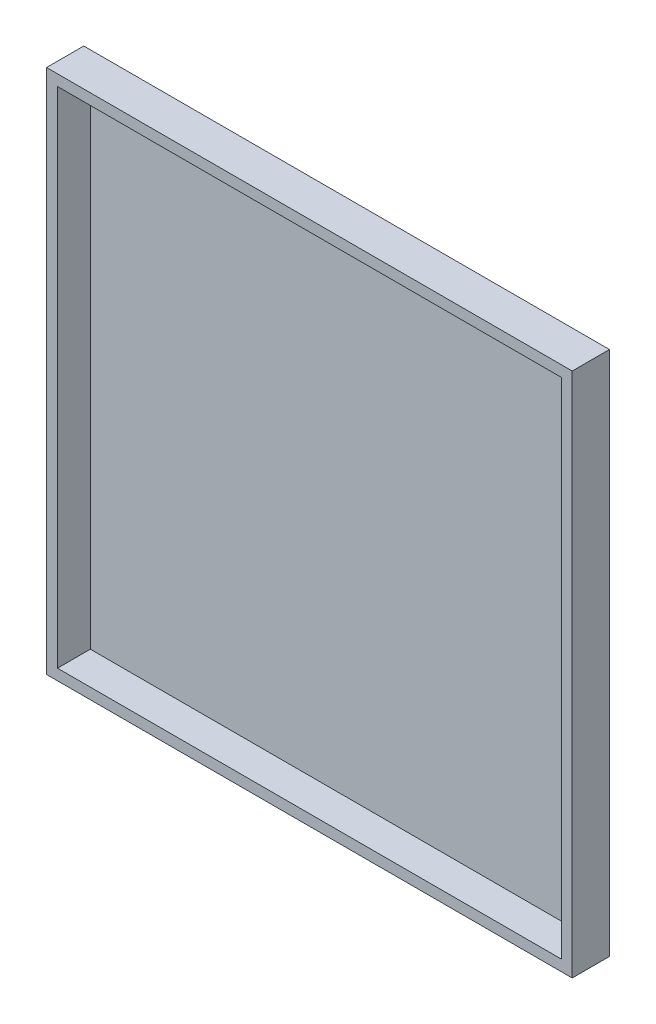
ISO-10303-21;
HEADER;
FILE_DESCRIPTION(('STEP AP214'),'2;1');
FILE_NAME('part.step','',(''),(''),'','','');
FILE_SCHEMA(('AUTOMOTIVE_DESIGN { 1 0 10303 214 1 1 1 1 }'));
ENDSEC;
DATA;
#1=APPLICATION_CONTEXT('core data for automotive mechanical design processes');
#2=APPLICATION_PROTOCOL_DEFINITION('international standard','automotive_design',2000,#1);
#3=PRODUCT_CONTEXT('',#1,'mechanical');
#4=PRODUCT('Part','Part','',(#3));
#5=PRODUCT_RELATED_PRODUCT_CATEGORY('part','',(#4));
#6=PRODUCT_DEFINITION_FORMATION('','',#4);
#7=PRODUCT_DEFINITION_CONTEXT('part definition',#1,'design');
#8=PRODUCT_DEFINITION('design','',#6,#7);
#9=PRODUCT_DEFINITION_SHAPE('','',#8);
#10=(LENGTH_UNIT() NAMED_UNIT(*) SI_UNIT(.MILLI.,.METRE.));
#11=(NAMED_UNIT(*) PLANE_ANGLE_UNIT() SI_UNIT($,.RADIAN.));
#12=(NAMED_UNIT(*) SI_UNIT($,.STERADIAN.) SOLID_ANGLE_UNIT());
#13=UNCERTAINTY_MEASURE_WITH_UNIT(LENGTH_MEASURE(1.E-05),#10,'distance_accuracy_value','');
#14=(GEOMETRIC_REPRESENTATION_CONTEXT(3) GLOBAL_UNCERTAINTY_ASSIGNED_CONTEXT((#13)) GLOBAL_UNIT_ASSIGNED_CONTEXT((#10,
#11,#12)) REPRESENTATION_CONTEXT('',''));
#15=CARTESIAN_POINT('',(0.,0.,0.));
#16=DIRECTION('',(0.,0.,1.));
#17=DIRECTION('',(1.,0.,0.));
#18=AXIS2_PLACEMENT_3D('',#15,#16,#17);
#19=CARTESIAN_POINT('',(-1200.,-1200.,20.));
#20=DIRECTION('',(1.,0.,0.));
#21=DIRECTION('',(0.,0.,-1.));
#22=AXIS2_PLACEMENT_3D('',#19,#20,#21);
#23=PLANE('',#22);
#24=DIRECTION('',(0.,-1.,0.));
#25=VECTOR('',#24,1.);
#26=CARTESIAN_POINT('',(-1200.,-1200.,0.));
#27=LINE('',#26,#25);
#28=CARTESIAN_POINT('',(-1200.,1200.,0.));
#29=VERTEX_POINT('',#28);
#30=CARTESIAN_POINT('',(-1200.,-1200.,0.));
#31=VERTEX_POINT('',#30);
#32=EDGE_CURVE('E145',#29,#31,#27,.T.);
#33=ORIENTED_EDGE('',*,*,#32,.T.);
#34=DIRECTION('',(0.,0.,-1.));
#35=VECTOR('',#34,1.);
#36=CARTESIAN_POINT('',(-1200.,-1200.,20.));
#37=LINE('',#36,#35);
#38=CARTESIAN_POINT('',(-1200.,-1200.,170.));
#39=VERTEX_POINT('',#38);
#40=EDGE_CURVE('E11',#39,#31,#37,.T.);
#41=ORIENTED_EDGE('',*,*,#40,.F.);
#42=DIRECTION('',(0.,-1.,0.));
#43=VECTOR('',#42,1.);
#44=CARTESIAN_POINT('',(-1200.,-1200.,170.));
#45=LINE('',#44,#43);
#46=CARTESIAN_POINT('',(-1200.,1200.,170.));
#47=VERTEX_POINT('',#46);
#48=EDGE_CURVE('E112',#47,#39,#45,.T.);
#49=ORIENTED_EDGE('',*,*,#48,.F.);
#50=DIRECTION('',(0.,0.,-1.));
#51=VECTOR('',#50,1.);
#52=CARTESIAN_POINT('',(-1200.,1200.,20.));
#53=LINE('',#52,#51);
#54=EDGE_CURVE('E154',#47,#29,#53,.T.);
#55=ORIENTED_EDGE('',*,*,#54,.T.);
#56=EDGE_LOOP('',(#33,#41,#49,#55));
#57=FACE_BOUND('',#56,.T.);
#58=ADVANCED_FACE('F34',(#57),#23,.F.);
#59=CARTESIAN_POINT('',(1200.,-1200.,20.));
#60=DIRECTION('',(0.,1.,0.));
#61=DIRECTION('',(-1.,0.,0.));
#62=AXIS2_PLACEMENT_3D('',#59,#60,#61);
#63=PLANE('',#62);
#64=DIRECTION('',(1.,0.,0.));
#65=VECTOR('',#64,1.);
#66=CARTESIAN_POINT('',(1200.,-1200.,0.));
#67=LINE('',#66,#65);
#68=CARTESIAN_POINT('',(1200.,-1200.,0.));
#69=VERTEX_POINT('',#68);
#70=EDGE_CURVE('E148',#31,#69,#67,.T.);
#71=ORIENTED_EDGE('',*,*,#70,.T.);
#72=DIRECTION('',(0.,0.,-1.));
#73=VECTOR('',#72,1.);
#74=CARTESIAN_POINT('',(1200.,-1200.,20.));
#75=LINE('',#74,#73);
#76=CARTESIAN_POINT('',(1200.,-1200.,170.));
#77=VERTEX_POINT('',#76);
#78=EDGE_CURVE('E41',#77,#69,#75,.T.);
#79=ORIENTED_EDGE('',*,*,#78,.F.);
#80=DIRECTION('',(1.,0.,0.));
#81=VECTOR('',#80,1.);
#82=CARTESIAN_POINT('',(1200.,-1200.,170.));
#83=LINE('',#82,#81);
#84=EDGE_CURVE('E136',#39,#77,#83,.T.);
#85=ORIENTED_EDGE('',*,*,#84,.F.);
#86=ORIENTED_EDGE('',*,*,#40,.T.);
#87=EDGE_LOOP('',(#71,#79,#85,#86));
#88=FACE_BOUND('',#87,.T.);
#89=ADVANCED_FACE('F176',(#88),#63,.F.);
#90=CARTESIAN_POINT('',(1200.,-1200.,20.));
#91=DIRECTION('',(-1.,0.,0.));
#92=DIRECTION('',(0.,0.,1.));
#93=AXIS2_PLACEMENT_3D('',#90,#91,#92);
#94=PLANE('',#93);
#95=DIRECTION('',(0.,1.,0.));
#96=VECTOR('',#95,1.);
#97=CARTESIAN_POINT('',(1200.,-1200.,0.));
#98=LINE('',#97,#96);
#99=CARTESIAN_POINT('',(1200.,1200.,0.));
#100=VERTEX_POINT('',#99);
#101=EDGE_CURVE('E150',#69,#100,#98,.T.);
#102=ORIENTED_EDGE('',*,*,#101,.T.);
#103=DIRECTION('',(0.,0.,-1.));
#104=VECTOR('',#103,1.);
#105=CARTESIAN_POINT('',(1200.,1200.,20.));
#106=LINE('',#105,#104);
#107=CARTESIAN_POINT('',(1200.,1200.,170.));
#108=VERTEX_POINT('',#107);
#109=EDGE_CURVE('E157',#108,#100,#106,.T.);
#110=ORIENTED_EDGE('',*,*,#109,.F.);
#111=DIRECTION('',(0.,1.,0.));
#112=VECTOR('',#111,1.);
#113=CARTESIAN_POINT('',(1200.,-1200.,170.));
#114=LINE('',#113,#112);
#115=EDGE_CURVE('E139',#77,#108,#114,.T.);
#116=ORIENTED_EDGE('',*,*,#115,.F.);
#117=ORIENTED_EDGE('',*,*,#78,.T.);
#118=EDGE_LOOP('',(#102,#110,#116,#117));
#119=FACE_BOUND('',#118,.T.);
#120=ADVANCED_FACE('F163',(#119),#94,.F.);
#121=CARTESIAN_POINT('',(1200.,1200.,20.));
#122=DIRECTION('',(0.,-1.,0.));
#123=DIRECTION('',(1.,0.,0.));
#124=AXIS2_PLACEMENT_3D('',#121,#122,#123);
#125=PLANE('',#124);
#126=DIRECTION('',(-1.,0.,0.));
#127=VECTOR('',#126,1.);
#128=CARTESIAN_POINT('',(1200.,1200.,0.));
#129=LINE('',#128,#127);
#130=EDGE_CURVE('E152',#100,#29,#129,.T.);
#131=ORIENTED_EDGE('',*,*,#130,.T.);
#132=ORIENTED_EDGE('',*,*,#54,.F.);
#133=DIRECTION('',(-1.,0.,0.));
#134=VECTOR('',#133,1.);
#135=CARTESIAN_POINT('',(1200.,1200.,170.));
#136=LINE('',#135,#134);
#137=EDGE_CURVE('E142',#108,#47,#136,.T.);
#138=ORIENTED_EDGE('',*,*,#137,.F.);
#139=ORIENTED_EDGE('',*,*,#109,.T.);
#140=EDGE_LOOP('',(#131,#132,#138,#139));
#141=FACE_BOUND('',#140,.T.);
#142=ADVANCED_FACE('F171',(#141),#125,.F.);
#143=CARTESIAN_POINT('',(0.,0.,0.));
#144=DIRECTION('',(0.,0.,1.));
#145=DIRECTION('',(1.,0.,0.));
#146=AXIS2_PLACEMENT_3D('',#143,#144,#145);
#147=PLANE('',#146);
#148=ORIENTED_EDGE('',*,*,#32,.F.);
#149=ORIENTED_EDGE('',*,*,#130,.F.);
#150=ORIENTED_EDGE('',*,*,#101,.F.);
#151=ORIENTED_EDGE('',*,*,#70,.F.);
#152=EDGE_LOOP('',(#148,#149,#150,#151));
#153=FACE_BOUND('',#152,.T.);
#154=ADVANCED_FACE('F169',(#153),#147,.F.);
#155=CARTESIAN_POINT('',(0.,0.,170.));
#156=DIRECTION('',(0.,0.,1.));
#157=DIRECTION('',(1.,0.,0.));
#158=AXIS2_PLACEMENT_3D('',#155,#156,#157);
#159=PLANE('',#158);
#160=ORIENTED_EDGE('',*,*,#48,.T.);
#161=ORIENTED_EDGE('',*,*,#84,.T.);
#162=ORIENTED_EDGE('',*,*,#115,.T.);
#163=ORIENTED_EDGE('',*,*,#137,.T.);
#164=EDGE_LOOP('',(#160,#161,#162,#163));
#165=FACE_BOUND('',#164,.T.);
#166=DIRECTION('',(1.,0.,0.));
#167=VECTOR('',#166,1.);
#168=CARTESIAN_POINT('',(-1150.,-1150.,170.));
#169=LINE('',#168,#167);
#170=CARTESIAN_POINT('',(-1150.,-1150.,170.));
#171=VERTEX_POINT('',#170);
#172=CARTESIAN_POINT('',(1150.,-1150.,170.));
#173=VERTEX_POINT('',#172);
#174=EDGE_CURVE('E106',#171,#173,#169,.T.);
#175=ORIENTED_EDGE('',*,*,#174,.F.);
#176=DIRECTION('',(0.,-1.,0.));
#177=VECTOR('',#176,1.);
#178=CARTESIAN_POINT('',(-1150.,1150.,170.));
#179=LINE('',#178,#177);
#180=CARTESIAN_POINT('',(-1150.,1150.,170.));
#181=VERTEX_POINT('',#180);
#182=EDGE_CURVE('E97',#181,#171,#179,.T.);
#183=ORIENTED_EDGE('',*,*,#182,.F.);
#184=DIRECTION('',(-1.,0.,0.));
#185=VECTOR('',#184,1.);
#186=CARTESIAN_POINT('',(1150.,1150.,170.));
#187=LINE('',#186,#185);
#188=CARTESIAN_POINT('',(1150.,1150.,170.));
#189=VERTEX_POINT('',#188);
#190=EDGE_CURVE('E120',#189,#181,#187,.T.);
#191=ORIENTED_EDGE('',*,*,#190,.F.);
#192=DIRECTION('',(0.,1.,0.));
#193=VECTOR('',#192,1.);
#194=CARTESIAN_POINT('',(1150.,-1150.,170.));
#195=LINE('',#194,#193);
#196=EDGE_CURVE('E118',#173,#189,#195,.T.);
#197=ORIENTED_EDGE('',*,*,#196,.F.);
#198=EDGE_LOOP('',(#175,#183,#191,#197));
#199=FACE_BOUND('',#198,.T.);
#200=ADVANCED_FACE('F116',(#165,#199),#159,.T.);
#201=CARTESIAN_POINT('',(-1150.,1150.,170.));
#202=DIRECTION('',(1.,0.,0.));
#203=DIRECTION('',(0.,0.,-1.));
#204=AXIS2_PLACEMENT_3D('',#201,#202,#203);
#205=PLANE('',#204);
#206=DIRECTION('',(0.,-1.,0.));
#207=VECTOR('',#206,1.);
#208=CARTESIAN_POINT('',(-1150.,1150.,20.));
#209=LINE('',#208,#207);
#210=CARTESIAN_POINT('',(-1150.,1150.,20.));
#211=VERTEX_POINT('',#210);
#212=CARTESIAN_POINT('',(-1150.,-1150.,20.));
#213=VERTEX_POINT('',#212);
#214=EDGE_CURVE('E48',#211,#213,#209,.T.);
#215=ORIENTED_EDGE('',*,*,#214,.F.);
#216=DIRECTION('',(0.,0.,-1.));
#217=VECTOR('',#216,1.);
#218=CARTESIAN_POINT('',(-1150.,1150.,170.));
#219=LINE('',#218,#217);
#220=EDGE_CURVE('E102',#181,#211,#219,.T.);
#221=ORIENTED_EDGE('',*,*,#220,.F.);
#222=ORIENTED_EDGE('',*,*,#182,.T.);
#223=DIRECTION('',(0.,0.,-1.));
#224=VECTOR('',#223,1.);
#225=CARTESIAN_POINT('',(-1150.,-1150.,170.));
#226=LINE('',#225,#224);
#227=EDGE_CURVE('E100',#171,#213,#226,.T.);
#228=ORIENTED_EDGE('',*,*,#227,.T.);
#229=EDGE_LOOP('',(#215,#221,#222,#228));
#230=FACE_BOUND('',#229,.T.);
#231=ADVANCED_FACE('F99',(#230),#205,.T.);
#232=CARTESIAN_POINT('',(-1150.,-1150.,170.));
#233=DIRECTION('',(0.,1.,0.));
#234=DIRECTION('',(-1.,0.,0.));
#235=AXIS2_PLACEMENT_3D('',#232,#233,#234);
#236=PLANE('',#235);
#237=DIRECTION('',(1.,0.,0.));
#238=VECTOR('',#237,1.);
#239=CARTESIAN_POINT('',(-1150.,-1150.,20.));
#240=LINE('',#239,#238);
#241=CARTESIAN_POINT('',(1150.,-1150.,20.));
#242=VERTEX_POINT('',#241);
#243=EDGE_CURVE('E52',#213,#242,#240,.T.);
#244=ORIENTED_EDGE('',*,*,#243,.F.);
#245=ORIENTED_EDGE('',*,*,#227,.F.);
#246=ORIENTED_EDGE('',*,*,#174,.T.);
#247=DIRECTION('',(0.,0.,-1.));
#248=VECTOR('',#247,1.);
#249=CARTESIAN_POINT('',(1150.,-1150.,170.));
#250=LINE('',#249,#248);
#251=EDGE_CURVE('E113',#173,#242,#250,.T.);
#252=ORIENTED_EDGE('',*,*,#251,.T.);
#253=EDGE_LOOP('',(#244,#245,#246,#252));
#254=FACE_BOUND('',#253,.T.);
#255=ADVANCED_FACE('F110',(#254),#236,.T.);
#256=CARTESIAN_POINT('',(1150.,-1150.,170.));
#257=DIRECTION('',(-1.,0.,0.));
#258=DIRECTION('',(0.,0.,1.));
#259=AXIS2_PLACEMENT_3D('',#256,#257,#258);
#260=PLANE('',#259);
#261=DIRECTION('',(0.,1.,0.));
#262=VECTOR('',#261,1.);
#263=CARTESIAN_POINT('',(1150.,-1150.,20.));
#264=LINE('',#263,#262);
#265=CARTESIAN_POINT('',(1150.,1150.,20.));
#266=VERTEX_POINT('',#265);
#267=EDGE_CURVE('E126',#242,#266,#264,.T.);
#268=ORIENTED_EDGE('',*,*,#267,.F.);
#269=ORIENTED_EDGE('',*,*,#251,.F.);
#270=ORIENTED_EDGE('',*,*,#196,.T.);
#271=DIRECTION('',(0.,0.,-1.));
#272=VECTOR('',#271,1.);
#273=CARTESIAN_POINT('',(1150.,1150.,170.));
#274=LINE('',#273,#272);
#275=EDGE_CURVE('E130',#189,#266,#274,.T.);
#276=ORIENTED_EDGE('',*,*,#275,.T.);
#277=EDGE_LOOP('',(#268,#269,#270,#276));
#278=FACE_BOUND('',#277,.T.);
#279=ADVANCED_FACE('F198',(#278),#260,.T.);
#280=CARTESIAN_POINT('',(1150.,1150.,170.));
#281=DIRECTION('',(0.,-1.,0.));
#282=DIRECTION('',(1.,0.,0.));
#283=AXIS2_PLACEMENT_3D('',#280,#281,#282);
#284=PLANE('',#283);
#285=DIRECTION('',(-1.,0.,0.));
#286=VECTOR('',#285,1.);
#287=CARTESIAN_POINT('',(1150.,1150.,20.));
#288=LINE('',#287,#286);
#289=EDGE_CURVE('E107',#266,#211,#288,.T.);
#290=ORIENTED_EDGE('',*,*,#289,.F.);
#291=ORIENTED_EDGE('',*,*,#275,.F.);
#292=ORIENTED_EDGE('',*,*,#190,.T.);
#293=ORIENTED_EDGE('',*,*,#220,.T.);
#294=EDGE_LOOP('',(#290,#291,#292,#293));
#295=FACE_BOUND('',#294,.T.);
#296=ADVANCED_FACE('F191',(#295),#284,.T.);
#297=CARTESIAN_POINT('',(0.,0.,20.));
#298=DIRECTION('',(0.,0.,1.));
#299=DIRECTION('',(1.,0.,0.));
#300=AXIS2_PLACEMENT_3D('',#297,#298,#299);
#301=PLANE('',#300);
#302=ORIENTED_EDGE('',*,*,#214,.T.);
#303=ORIENTED_EDGE('',*,*,#243,.T.);
#304=ORIENTED_EDGE('',*,*,#267,.T.);
#305=ORIENTED_EDGE('',*,*,#289,.T.);
#306=EDGE_LOOP('',(#302,#303,#304,#305));
#307=FACE_BOUND('',#306,.T.);
#308=ADVANCED_FACE('F188',(#307),#301,.T.);
#309=CLOSED_SHELL('',(#58,#89,#120,#142,#154,#200,#231,#255,#279,#296,#308));
#310=MANIFOLD_SOLID_BREP('B2',#309);
#311=ADVANCED_BREP_SHAPE_REPRESENTATION('',(#18,#310),#14);
#312=SHAPE_DEFINITION_REPRESENTATION(#9,#311);
ENDSEC;
END-ISO-10303-21;
